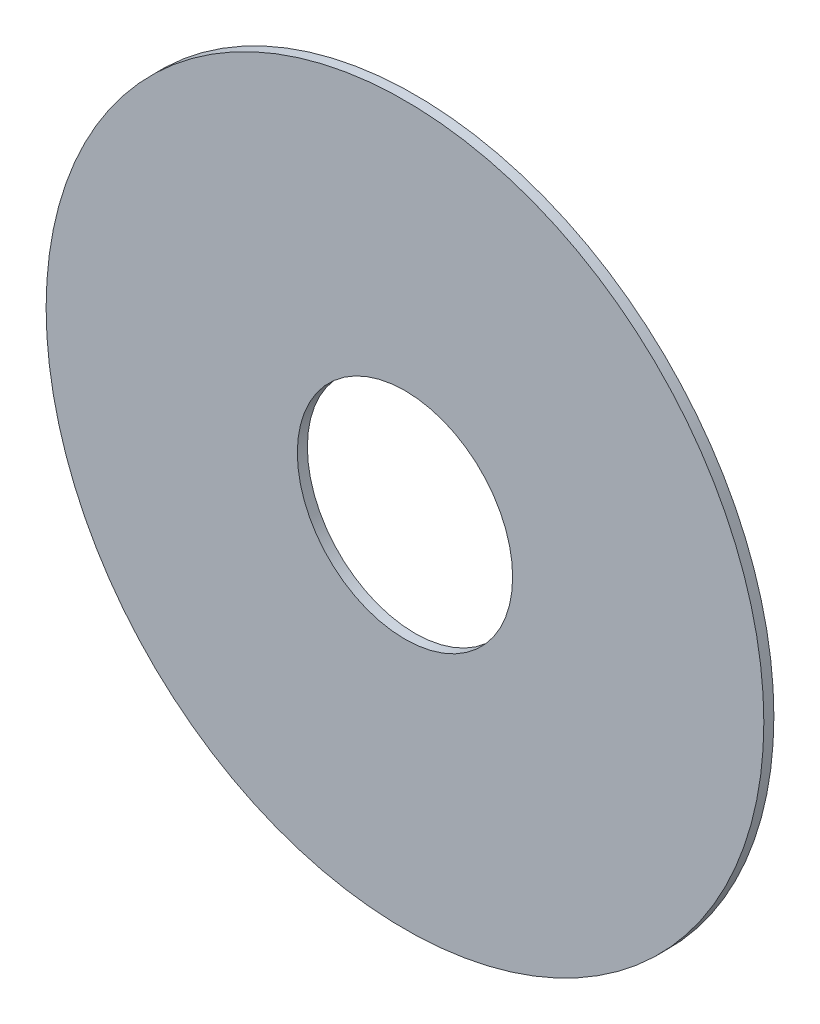
ISO-10303-21;
HEADER;
FILE_DESCRIPTION(('STEP AP214'),'2;1');
FILE_NAME('part.step','',(''),(''),'','','');
FILE_SCHEMA(('AUTOMOTIVE_DESIGN { 1 0 10303 214 1 1 1 1 }'));
ENDSEC;
DATA;
#1=APPLICATION_CONTEXT('core data for automotive mechanical design processes');
#2=APPLICATION_PROTOCOL_DEFINITION('international standard','automotive_design',2000,#1);
#3=PRODUCT_CONTEXT('',#1,'mechanical');
#4=PRODUCT('Part','Part','',(#3));
#5=PRODUCT_RELATED_PRODUCT_CATEGORY('part','',(#4));
#6=PRODUCT_DEFINITION_FORMATION('','',#4);
#7=PRODUCT_DEFINITION_CONTEXT('part definition',#1,'design');
#8=PRODUCT_DEFINITION('design','',#6,#7);
#9=PRODUCT_DEFINITION_SHAPE('','',#8);
#10=(LENGTH_UNIT() NAMED_UNIT(*) SI_UNIT(.MILLI.,.METRE.));
#11=(NAMED_UNIT(*) PLANE_ANGLE_UNIT() SI_UNIT($,.RADIAN.));
#12=(NAMED_UNIT(*) SI_UNIT($,.STERADIAN.) SOLID_ANGLE_UNIT());
#13=UNCERTAINTY_MEASURE_WITH_UNIT(LENGTH_MEASURE(1.E-05),#10,'distance_accuracy_value','');
#14=(GEOMETRIC_REPRESENTATION_CONTEXT(3) GLOBAL_UNCERTAINTY_ASSIGNED_CONTEXT((#13)) GLOBAL_UNIT_ASSIGNED_CONTEXT((#10,
#11,#12)) REPRESENTATION_CONTEXT('',''));
#15=CARTESIAN_POINT('',(0.,0.,0.));
#16=DIRECTION('',(0.,0.,1.));
#17=DIRECTION('',(1.,0.,0.));
#18=AXIS2_PLACEMENT_3D('',#15,#16,#17);
#19=CARTESIAN_POINT('',(173.228,-102.616,-0.045));
#20=DIRECTION('',(0.,0.,-1.));
#21=DIRECTION('',(0.,-1.,0.));
#22=AXIS2_PLACEMENT_3D('',#19,#20,#21);
#23=CYLINDRICAL_SURFACE('',#22,0.375);
#24=CARTESIAN_POINT('',(173.228,-102.616,1.67));
#25=DIRECTION('',(0.,0.,-1.));
#26=DIRECTION('',(0.,-1.,0.));
#27=AXIS2_PLACEMENT_3D('',#24,#25,#26);
#28=CIRCLE('',#27,0.375);
#29=CARTESIAN_POINT('',(173.228,-102.991,1.67));
#30=VERTEX_POINT('',#29);
#31=EDGE_CURVE('E20',#30,#30,#28,.T.);
#32=ORIENTED_EDGE('',*,*,#31,.T.);
#33=DIRECTION('',(0.,0.,1.));
#34=VECTOR('',#33,1.);
#35=CARTESIAN_POINT('',(173.228,-102.991,-0.045));
#36=LINE('',#35,#34);
#37=CARTESIAN_POINT('',(173.228,-102.991,1.705));
#38=VERTEX_POINT('',#37);
#39=EDGE_CURVE('E11',#30,#38,#36,.T.);
#40=ORIENTED_EDGE('',*,*,#39,.T.);
#41=CARTESIAN_POINT('',(173.228,-102.616,1.705));
#42=DIRECTION('',(0.,0.,-1.));
#43=DIRECTION('',(0.,-1.,0.));
#44=AXIS2_PLACEMENT_3D('',#41,#42,#43);
#45=CIRCLE('',#44,0.375);
#46=EDGE_CURVE('E69',#38,#38,#45,.T.);
#47=ORIENTED_EDGE('',*,*,#46,.F.);
#48=ORIENTED_EDGE('',*,*,#39,.F.);
#49=EDGE_LOOP('',(#32,#40,#47,#48));
#50=FACE_BOUND('',#49,.T.);
#51=ADVANCED_FACE('F17',(#50),#23,.F.);
#52=CARTESIAN_POINT('',(173.228,-102.616,1.67));
#53=DIRECTION('',(0.,0.,1.));
#54=DIRECTION('',(1.,0.,0.));
#55=AXIS2_PLACEMENT_3D('',#52,#53,#54);
#56=PLANE('',#55);
#57=ORIENTED_EDGE('',*,*,#31,.F.);
#58=EDGE_LOOP('',(#57));
#59=FACE_BOUND('',#58,.T.);
#60=CARTESIAN_POINT('',(173.228,-102.616,1.67));
#61=DIRECTION('',(0.,0.,1.));
#62=DIRECTION('',(1.,0.,0.));
#63=AXIS2_PLACEMENT_3D('',#60,#61,#62);
#64=CIRCLE('',#63,1.25);
#65=CARTESIAN_POINT('',(174.478,-102.616,1.67));
#66=VERTEX_POINT('',#65);
#67=EDGE_CURVE('E57',#66,#66,#64,.T.);
#68=ORIENTED_EDGE('',*,*,#67,.F.);
#69=EDGE_LOOP('',(#68));
#70=FACE_BOUND('',#69,.T.);
#71=ADVANCED_FACE('F79',(#59,#70),#56,.F.);
#72=CARTESIAN_POINT('',(173.228,-102.616,1.705));
#73=DIRECTION('',(0.,0.,1.));
#74=DIRECTION('',(1.,0.,0.));
#75=AXIS2_PLACEMENT_3D('',#72,#73,#74);
#76=PLANE('',#75);
#77=ORIENTED_EDGE('',*,*,#46,.T.);
#78=EDGE_LOOP('',(#77));
#79=FACE_BOUND('',#78,.T.);
#80=CARTESIAN_POINT('',(173.228,-102.616,1.705));
#81=DIRECTION('',(0.,0.,1.));
#82=DIRECTION('',(1.,0.,0.));
#83=AXIS2_PLACEMENT_3D('',#80,#81,#82);
#84=CIRCLE('',#83,1.25);
#85=CARTESIAN_POINT('',(174.478,-102.616,1.705));
#86=VERTEX_POINT('',#85);
#87=EDGE_CURVE('E55',#86,#86,#84,.T.);
#88=ORIENTED_EDGE('',*,*,#87,.T.);
#89=EDGE_LOOP('',(#88));
#90=FACE_BOUND('',#89,.T.);
#91=ADVANCED_FACE('F61',(#79,#90),#76,.T.);
#92=CARTESIAN_POINT('',(173.228,-102.616,1.67));
#93=DIRECTION('',(0.,0.,1.));
#94=DIRECTION('',(1.,0.,0.));
#95=AXIS2_PLACEMENT_3D('',#92,#93,#94);
#96=CYLINDRICAL_SURFACE('',#95,1.25);
#97=ORIENTED_EDGE('',*,*,#87,.F.);
#98=DIRECTION('',(0.,0.,1.));
#99=VECTOR('',#98,1.);
#100=CARTESIAN_POINT('',(174.478,-102.616,1.67));
#101=LINE('',#100,#99);
#102=EDGE_CURVE('E52',#66,#86,#101,.T.);
#103=ORIENTED_EDGE('',*,*,#102,.F.);
#104=ORIENTED_EDGE('',*,*,#67,.T.);
#105=ORIENTED_EDGE('',*,*,#102,.T.);
#106=EDGE_LOOP('',(#97,#103,#104,#105));
#107=FACE_BOUND('',#106,.T.);
#108=ADVANCED_FACE('F54',(#107),#96,.T.);
#109=CLOSED_SHELL('',(#51,#71,#91,#108));
#110=MANIFOLD_SOLID_BREP('B1',#109);
#111=ADVANCED_BREP_SHAPE_REPRESENTATION('',(#18,#110),#14);
#112=SHAPE_DEFINITION_REPRESENTATION(#9,#111);
ENDSEC;
END-ISO-10303-21;
